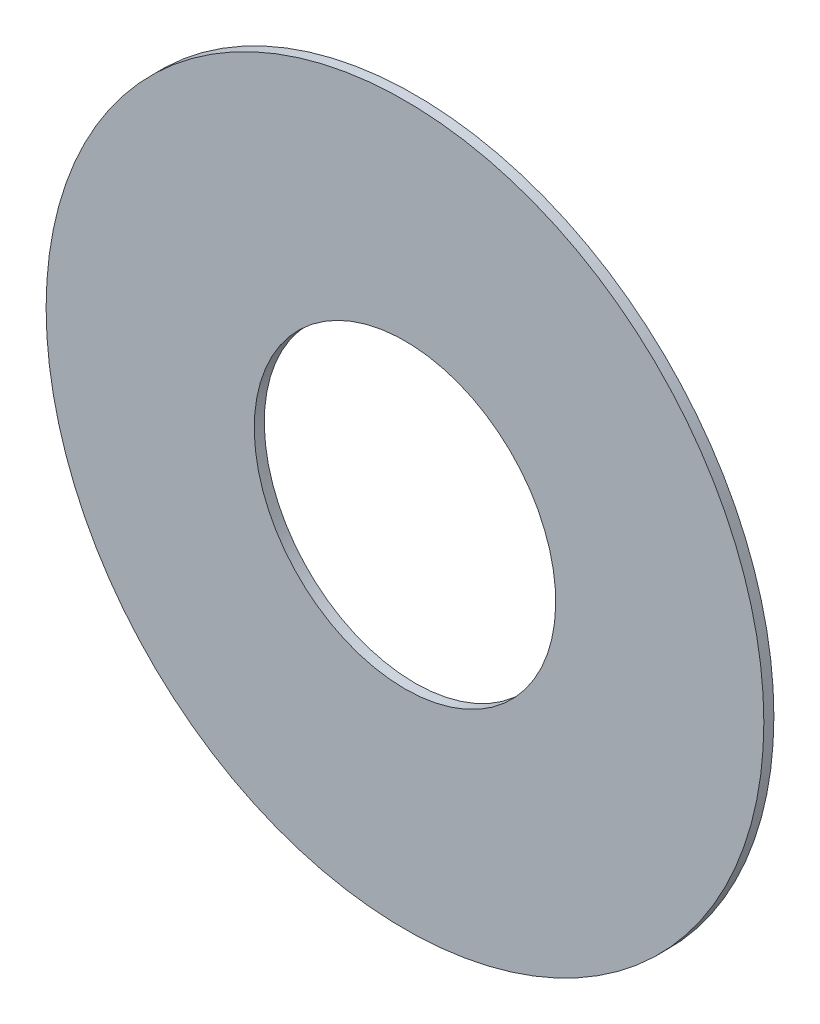
ISO-10303-21;
HEADER;
FILE_DESCRIPTION(('STEP AP214'),'2;1');
FILE_NAME('part.step','',(''),(''),'','','');
FILE_SCHEMA(('AUTOMOTIVE_DESIGN { 1 0 10303 214 1 1 1 1 }'));
ENDSEC;
DATA;
#1=APPLICATION_CONTEXT('core data for automotive mechanical design processes');
#2=APPLICATION_PROTOCOL_DEFINITION('international standard','automotive_design',2000,#1);
#3=PRODUCT_CONTEXT('',#1,'mechanical');
#4=PRODUCT('Part','Part','',(#3));
#5=PRODUCT_RELATED_PRODUCT_CATEGORY('part','',(#4));
#6=PRODUCT_DEFINITION_FORMATION('','',#4);
#7=PRODUCT_DEFINITION_CONTEXT('part definition',#1,'design');
#8=PRODUCT_DEFINITION('design','',#6,#7);
#9=PRODUCT_DEFINITION_SHAPE('','',#8);
#10=(LENGTH_UNIT() NAMED_UNIT(*) SI_UNIT(.MILLI.,.METRE.));
#11=(NAMED_UNIT(*) PLANE_ANGLE_UNIT() SI_UNIT($,.RADIAN.));
#12=(NAMED_UNIT(*) SI_UNIT($,.STERADIAN.) SOLID_ANGLE_UNIT());
#13=UNCERTAINTY_MEASURE_WITH_UNIT(LENGTH_MEASURE(1.E-05),#10,'distance_accuracy_value','');
#14=(GEOMETRIC_REPRESENTATION_CONTEXT(3) GLOBAL_UNCERTAINTY_ASSIGNED_CONTEXT((#13)) GLOBAL_UNIT_ASSIGNED_CONTEXT((#10,
#11,#12)) REPRESENTATION_CONTEXT('',''));
#15=CARTESIAN_POINT('',(0.,0.,0.));
#16=DIRECTION('',(0.,0.,1.));
#17=DIRECTION('',(1.,0.,0.));
#18=AXIS2_PLACEMENT_3D('',#15,#16,#17);
#19=CARTESIAN_POINT('',(158.952,-126.034,-0.045));
#20=DIRECTION('',(0.,0.,-1.));
#21=DIRECTION('',(0.,-1.,0.));
#22=AXIS2_PLACEMENT_3D('',#19,#20,#21);
#23=CYLINDRICAL_SURFACE('',#22,0.525);
#24=CARTESIAN_POINT('',(158.952,-126.034,-0.035));
#25=DIRECTION('',(0.,0.,-1.));
#26=DIRECTION('',(0.,-1.,0.));
#27=AXIS2_PLACEMENT_3D('',#24,#25,#26);
#28=CIRCLE('',#27,0.525);
#29=CARTESIAN_POINT('',(158.952,-126.559,-0.035));
#30=VERTEX_POINT('',#29);
#31=EDGE_CURVE('E25',#30,#30,#28,.T.);
#32=ORIENTED_EDGE('',*,*,#31,.T.);
#33=DIRECTION('',(0.,0.,1.));
#34=VECTOR('',#33,1.);
#35=CARTESIAN_POINT('',(158.952,-126.559,-0.045));
#36=LINE('',#35,#34);
#37=CARTESIAN_POINT('',(158.952,-126.559,0.));
#38=VERTEX_POINT('',#37);
#39=EDGE_CURVE('E11',#30,#38,#36,.T.);
#40=ORIENTED_EDGE('',*,*,#39,.T.);
#41=CARTESIAN_POINT('',(158.952,-126.034,0.));
#42=DIRECTION('',(0.,0.,-1.));
#43=DIRECTION('',(0.,-1.,0.));
#44=AXIS2_PLACEMENT_3D('',#41,#42,#43);
#45=CIRCLE('',#44,0.525);
#46=EDGE_CURVE('E68',#38,#38,#45,.T.);
#47=ORIENTED_EDGE('',*,*,#46,.F.);
#48=ORIENTED_EDGE('',*,*,#39,.F.);
#49=EDGE_LOOP('',(#32,#40,#47,#48));
#50=FACE_BOUND('',#49,.T.);
#51=ADVANCED_FACE('F17',(#50),#23,.F.);
#52=CARTESIAN_POINT('',(158.952,-126.034,-0.035));
#53=DIRECTION('',(0.,0.,1.));
#54=DIRECTION('',(1.,0.,0.));
#55=AXIS2_PLACEMENT_3D('',#52,#53,#54);
#56=PLANE('',#55);
#57=ORIENTED_EDGE('',*,*,#31,.F.);
#58=EDGE_LOOP('',(#57));
#59=FACE_BOUND('',#58,.T.);
#60=CARTESIAN_POINT('',(158.952,-126.034,-0.035));
#61=DIRECTION('',(0.,0.,1.));
#62=DIRECTION('',(1.,0.,0.));
#63=AXIS2_PLACEMENT_3D('',#60,#61,#62);
#64=CIRCLE('',#63,1.25);
#65=CARTESIAN_POINT('',(160.202,-126.034,-0.035));
#66=VERTEX_POINT('',#65);
#67=EDGE_CURVE('E56',#66,#66,#64,.T.);
#68=ORIENTED_EDGE('',*,*,#67,.F.);
#69=EDGE_LOOP('',(#68));
#70=FACE_BOUND('',#69,.T.);
#71=ADVANCED_FACE('F76',(#59,#70),#56,.F.);
#72=CARTESIAN_POINT('',(158.952,-126.034,0.));
#73=DIRECTION('',(0.,0.,1.));
#74=DIRECTION('',(1.,0.,0.));
#75=AXIS2_PLACEMENT_3D('',#72,#73,#74);
#76=PLANE('',#75);
#77=ORIENTED_EDGE('',*,*,#46,.T.);
#78=EDGE_LOOP('',(#77));
#79=FACE_BOUND('',#78,.T.);
#80=CARTESIAN_POINT('',(158.952,-126.034,0.));
#81=DIRECTION('',(0.,0.,1.));
#82=DIRECTION('',(1.,0.,0.));
#83=AXIS2_PLACEMENT_3D('',#80,#81,#82);
#84=CIRCLE('',#83,1.25);
#85=CARTESIAN_POINT('',(160.202,-126.034,0.));
#86=VERTEX_POINT('',#85);
#87=EDGE_CURVE('E54',#86,#86,#84,.T.);
#88=ORIENTED_EDGE('',*,*,#87,.T.);
#89=EDGE_LOOP('',(#88));
#90=FACE_BOUND('',#89,.T.);
#91=ADVANCED_FACE('F60',(#79,#90),#76,.T.);
#92=CARTESIAN_POINT('',(158.952,-126.034,-0.035));
#93=DIRECTION('',(0.,0.,1.));
#94=DIRECTION('',(1.,0.,0.));
#95=AXIS2_PLACEMENT_3D('',#92,#93,#94);
#96=CYLINDRICAL_SURFACE('',#95,1.25);
#97=ORIENTED_EDGE('',*,*,#87,.F.);
#98=DIRECTION('',(0.,0.,1.));
#99=VECTOR('',#98,1.);
#100=CARTESIAN_POINT('',(160.202,-126.034,-0.035));
#101=LINE('',#100,#99);
#102=EDGE_CURVE('E51',#66,#86,#101,.T.);
#103=ORIENTED_EDGE('',*,*,#102,.F.);
#104=ORIENTED_EDGE('',*,*,#67,.T.);
#105=ORIENTED_EDGE('',*,*,#102,.T.);
#106=EDGE_LOOP('',(#97,#103,#104,#105));
#107=FACE_BOUND('',#106,.T.);
#108=ADVANCED_FACE('F53',(#107),#96,.T.);
#109=CLOSED_SHELL('',(#51,#71,#91,#108));
#110=MANIFOLD_SOLID_BREP('B1',#109);
#111=ADVANCED_BREP_SHAPE_REPRESENTATION('',(#18,#110),#14);
#112=SHAPE_DEFINITION_REPRESENTATION(#9,#111);
ENDSEC;
END-ISO-10303-21;
